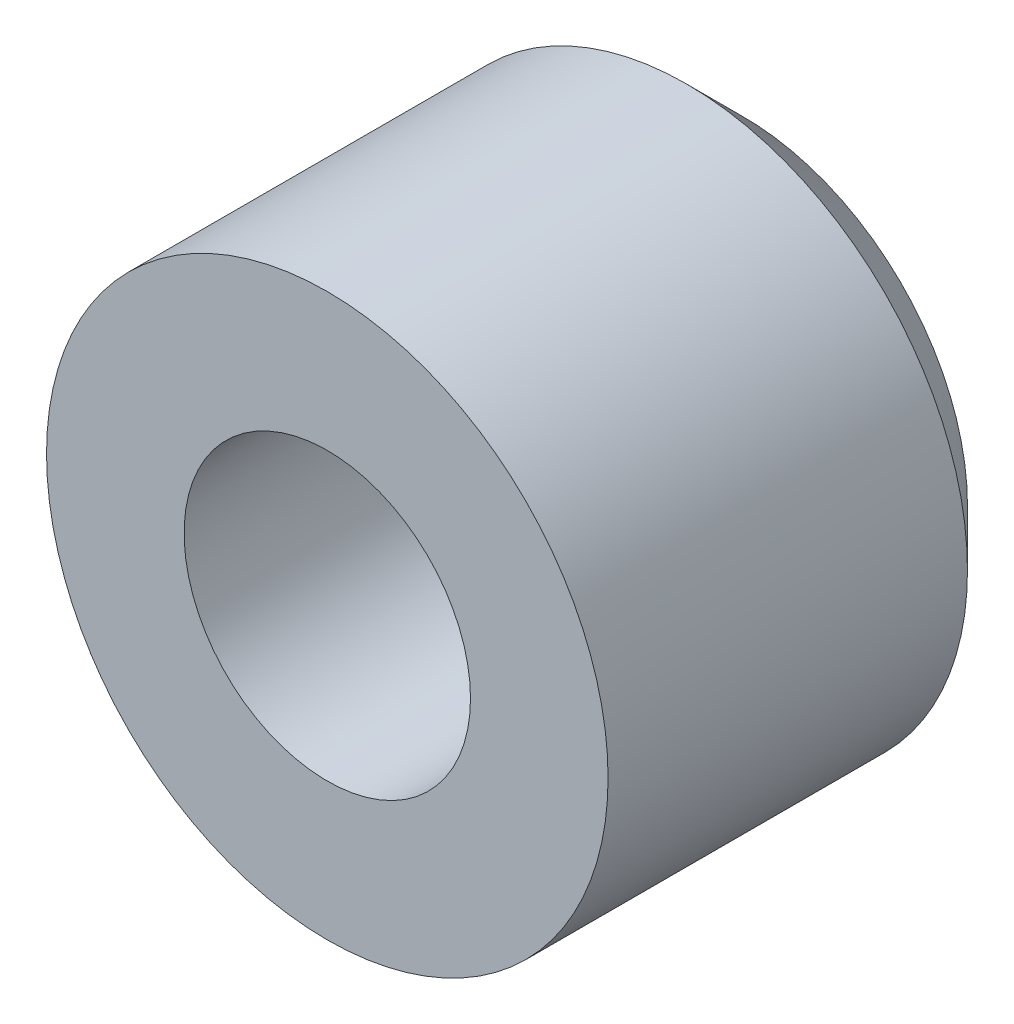
ISO-10303-21;
HEADER;
FILE_DESCRIPTION(('STEP AP214'),'2;1');
FILE_NAME('part.step','',(''),(''),'','','');
FILE_SCHEMA(('AUTOMOTIVE_DESIGN { 1 0 10303 214 1 1 1 1 }'));
ENDSEC;
DATA;
#1=APPLICATION_CONTEXT('core data for automotive mechanical design processes');
#2=APPLICATION_PROTOCOL_DEFINITION('international standard','automotive_design',2000,#1);
#3=PRODUCT_CONTEXT('',#1,'mechanical');
#4=PRODUCT('Part','Part','',(#3));
#5=PRODUCT_RELATED_PRODUCT_CATEGORY('part','',(#4));
#6=PRODUCT_DEFINITION_FORMATION('','',#4);
#7=PRODUCT_DEFINITION_CONTEXT('part definition',#1,'design');
#8=PRODUCT_DEFINITION('design','',#6,#7);
#9=PRODUCT_DEFINITION_SHAPE('','',#8);
#10=(LENGTH_UNIT() NAMED_UNIT(*) SI_UNIT(.MILLI.,.METRE.));
#11=(NAMED_UNIT(*) PLANE_ANGLE_UNIT() SI_UNIT($,.RADIAN.));
#12=(NAMED_UNIT(*) SI_UNIT($,.STERADIAN.) SOLID_ANGLE_UNIT());
#13=UNCERTAINTY_MEASURE_WITH_UNIT(LENGTH_MEASURE(1.E-05),#10,'distance_accuracy_value','');
#14=(GEOMETRIC_REPRESENTATION_CONTEXT(3) GLOBAL_UNCERTAINTY_ASSIGNED_CONTEXT((#13)) GLOBAL_UNIT_ASSIGNED_CONTEXT((#10,
#11,#12)) REPRESENTATION_CONTEXT('',''));
#15=CARTESIAN_POINT('',(0.,0.,0.));
#16=DIRECTION('',(0.,0.,1.));
#17=DIRECTION('',(1.,0.,0.));
#18=AXIS2_PLACEMENT_3D('',#15,#16,#17);
#19=CARTESIAN_POINT('',(0.,0.,7.4));
#20=DIRECTION('',(0.,0.,1.));
#21=DIRECTION('',(1.,0.,0.));
#22=AXIS2_PLACEMENT_3D('',#19,#20,#21);
#23=PLANE('',#22);
#24=CARTESIAN_POINT('',(0.,0.,7.4));
#25=DIRECTION('',(0.,0.,1.));
#26=DIRECTION('',(1.,0.,0.));
#27=AXIS2_PLACEMENT_3D('',#24,#25,#26);
#28=CIRCLE('',#27,5.);
#29=CARTESIAN_POINT('',(5.,0.,7.4));
#30=VERTEX_POINT('',#29);
#31=EDGE_CURVE('E45',#30,#30,#28,.T.);
#32=ORIENTED_EDGE('',*,*,#31,.T.);
#33=EDGE_LOOP('',(#32));
#34=FACE_BOUND('',#33,.T.);
#35=CARTESIAN_POINT('',(0.,0.,7.4));
#36=DIRECTION('',(0.,0.,1.));
#37=DIRECTION('',(1.,0.,0.));
#38=AXIS2_PLACEMENT_3D('',#35,#36,#37);
#39=CIRCLE('',#38,2.55);
#40=CARTESIAN_POINT('',(2.55,0.,7.4));
#41=VERTEX_POINT('',#40);
#42=EDGE_CURVE('E49',#41,#41,#39,.T.);
#43=ORIENTED_EDGE('',*,*,#42,.F.);
#44=EDGE_LOOP('',(#43));
#45=FACE_BOUND('',#44,.T.);
#46=ADVANCED_FACE('F34',(#34,#45),#23,.T.);
#47=CARTESIAN_POINT('',(0.,0.,0.));
#48=DIRECTION('',(0.,0.,1.));
#49=DIRECTION('',(1.,0.,0.));
#50=AXIS2_PLACEMENT_3D('',#47,#48,#49);
#51=PLANE('',#50);
#52=CARTESIAN_POINT('',(0.,0.,0.));
#53=DIRECTION('',(0.,0.,1.));
#54=DIRECTION('',(1.,0.,0.));
#55=AXIS2_PLACEMENT_3D('',#52,#53,#54);
#56=CIRCLE('',#55,4.);
#57=CARTESIAN_POINT('',(4.,0.,0.));
#58=VERTEX_POINT('',#57);
#59=EDGE_CURVE('E10',#58,#58,#56,.F.);
#60=ORIENTED_EDGE('',*,*,#59,.T.);
#61=EDGE_LOOP('',(#60));
#62=FACE_BOUND('',#61,.T.);
#63=CARTESIAN_POINT('',(0.,0.,0.));
#64=DIRECTION('',(0.,0.,1.));
#65=DIRECTION('',(1.,0.,0.));
#66=AXIS2_PLACEMENT_3D('',#63,#64,#65);
#67=CIRCLE('',#66,2.55);
#68=CARTESIAN_POINT('',(2.55,0.,0.));
#69=VERTEX_POINT('',#68);
#70=EDGE_CURVE('E52',#69,#69,#67,.T.);
#71=ORIENTED_EDGE('',*,*,#70,.T.);
#72=EDGE_LOOP('',(#71));
#73=FACE_BOUND('',#72,.T.);
#74=ADVANCED_FACE('F62',(#62,#73),#51,.F.);
#75=CARTESIAN_POINT('',(0.,0.,7.4));
#76=DIRECTION('',(0.,0.,-1.));
#77=DIRECTION('',(-1.,0.,0.));
#78=AXIS2_PLACEMENT_3D('',#75,#76,#77);
#79=CYLINDRICAL_SURFACE('',#78,5.);
#80=CARTESIAN_POINT('',(0.,0.,0.999999999999998));
#81=DIRECTION('',(0.,0.,1.));
#82=DIRECTION('',(1.,0.,0.));
#83=AXIS2_PLACEMENT_3D('',#80,#81,#82);
#84=CIRCLE('',#83,5.);
#85=CARTESIAN_POINT('',(5.,0.,0.999999999999998));
#86=VERTEX_POINT('',#85);
#87=EDGE_CURVE('E41',#86,#86,#84,.T.);
#88=ORIENTED_EDGE('',*,*,#87,.T.);
#89=EDGE_LOOP('',(#88));
#90=FACE_BOUND('',#89,.T.);
#91=ORIENTED_EDGE('',*,*,#31,.F.);
#92=EDGE_LOOP('',(#91));
#93=FACE_BOUND('',#92,.T.);
#94=ADVANCED_FACE('F68',(#90,#93),#79,.T.);
#95=CARTESIAN_POINT('',(0.,0.,7.4));
#96=DIRECTION('',(0.,0.,-1.));
#97=DIRECTION('',(-1.,0.,0.));
#98=AXIS2_PLACEMENT_3D('',#95,#96,#97);
#99=CYLINDRICAL_SURFACE('',#98,2.55);
#100=ORIENTED_EDGE('',*,*,#42,.T.);
#101=EDGE_LOOP('',(#100));
#102=FACE_BOUND('',#101,.T.);
#103=ORIENTED_EDGE('',*,*,#70,.F.);
#104=EDGE_LOOP('',(#103));
#105=FACE_BOUND('',#104,.T.);
#106=ADVANCED_FACE('F58',(#102,#105),#99,.F.);
#107=CARTESIAN_POINT('',(0.,0.,0.999999999999998));
#108=DIRECTION('',(0.,0.,1.));
#109=DIRECTION('',(1.,0.,0.));
#110=AXIS2_PLACEMENT_3D('',#107,#108,#109);
#111=CONICAL_SURFACE('',#110,5.,0.78539816339745);
#112=ORIENTED_EDGE('',*,*,#59,.F.);
#113=EDGE_LOOP('',(#112));
#114=FACE_BOUND('',#113,.T.);
#115=ORIENTED_EDGE('',*,*,#87,.F.);
#116=EDGE_LOOP('',(#115));
#117=FACE_BOUND('',#116,.T.);
#118=ADVANCED_FACE('F36',(#114,#117),#111,.T.);
#119=CLOSED_SHELL('',(#46,#74,#94,#106,#118));
#120=MANIFOLD_SOLID_BREP('B2',#119);
#121=ADVANCED_BREP_SHAPE_REPRESENTATION('',(#18,#120),#14);
#122=SHAPE_DEFINITION_REPRESENTATION(#9,#121);
ENDSEC;
END-ISO-10303-21;
